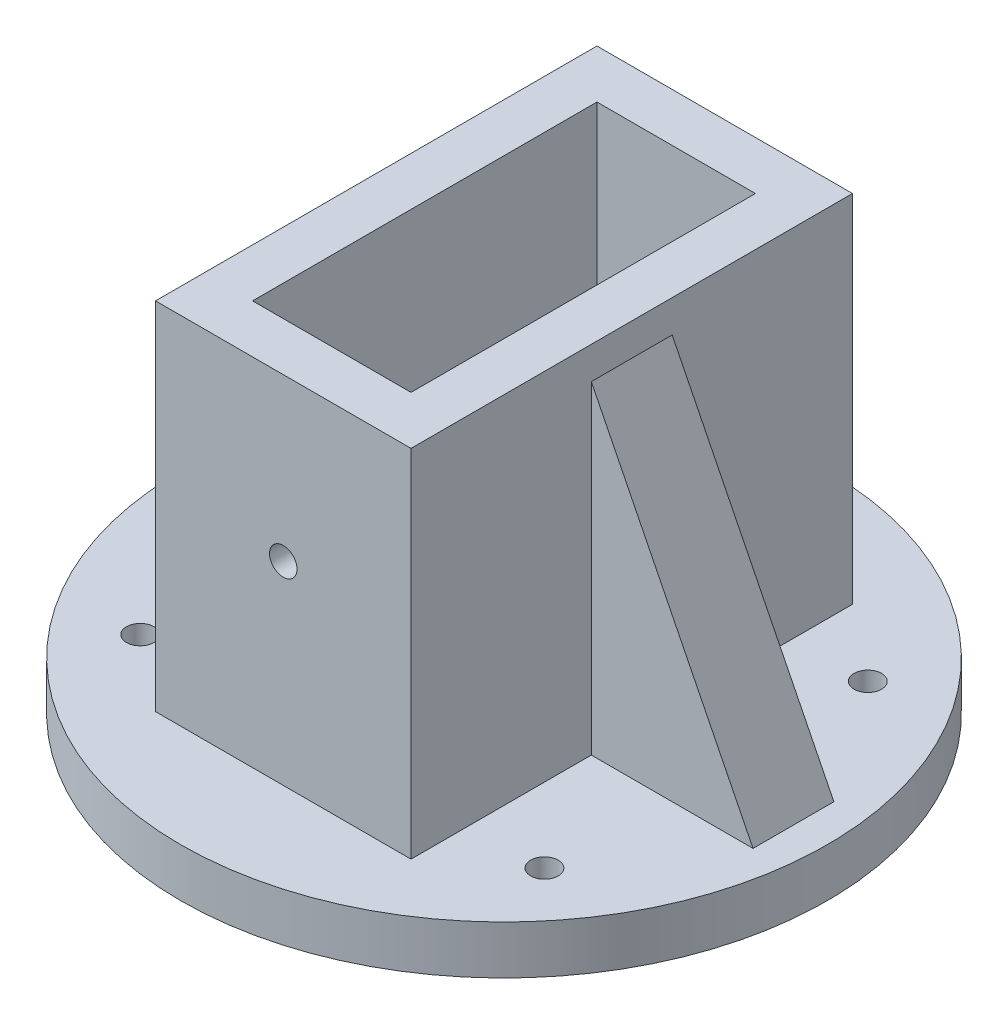
ISO-10303-21;
HEADER;
FILE_DESCRIPTION(('STEP AP214'),'2;1');
FILE_NAME('part.step','',(''),(''),'','','');
FILE_SCHEMA(('AUTOMOTIVE_DESIGN { 1 0 10303 214 1 1 1 1 }'));
ENDSEC;
DATA;
#1=APPLICATION_CONTEXT('core data for automotive mechanical design processes');
#2=APPLICATION_PROTOCOL_DEFINITION('international standard','automotive_design',2000,#1);
#3=PRODUCT_CONTEXT('',#1,'mechanical');
#4=PRODUCT('Part','Part','',(#3));
#5=PRODUCT_RELATED_PRODUCT_CATEGORY('part','',(#4));
#6=PRODUCT_DEFINITION_FORMATION('','',#4);
#7=PRODUCT_DEFINITION_CONTEXT('part definition',#1,'design');
#8=PRODUCT_DEFINITION('design','',#6,#7);
#9=PRODUCT_DEFINITION_SHAPE('','',#8);
#10=(LENGTH_UNIT() NAMED_UNIT(*) SI_UNIT(.MILLI.,.METRE.));
#11=(NAMED_UNIT(*) PLANE_ANGLE_UNIT() SI_UNIT($,.RADIAN.));
#12=(NAMED_UNIT(*) SI_UNIT($,.STERADIAN.) SOLID_ANGLE_UNIT());
#13=UNCERTAINTY_MEASURE_WITH_UNIT(LENGTH_MEASURE(1.E-05),#10,'distance_accuracy_value','');
#14=(GEOMETRIC_REPRESENTATION_CONTEXT(3) GLOBAL_UNCERTAINTY_ASSIGNED_CONTEXT((#13)) GLOBAL_UNIT_ASSIGNED_CONTEXT((#10,
#11,#12)) REPRESENTATION_CONTEXT('',''));
#15=CARTESIAN_POINT('',(0.,0.,0.));
#16=DIRECTION('',(0.,0.,1.));
#17=DIRECTION('',(1.,0.,0.));
#18=AXIS2_PLACEMENT_3D('',#15,#16,#17);
#19=CARTESIAN_POINT('',(-15.8,50.,27.3));
#20=DIRECTION('',(1.,0.,0.));
#21=DIRECTION('',(0.,0.,-1.));
#22=AXIS2_PLACEMENT_3D('',#19,#20,#21);
#23=PLANE('',#22);
#24=DIRECTION('',(0.,-1.,0.));
#25=VECTOR('',#24,1.);
#26=CARTESIAN_POINT('',(-15.8,50.,27.3));
#27=LINE('',#26,#25);
#28=CARTESIAN_POINT('',(-15.8,50.,27.3));
#29=VERTEX_POINT('',#28);
#30=CARTESIAN_POINT('',(-15.8,6.,27.3));
#31=VERTEX_POINT('',#30);
#32=EDGE_CURVE('E48',#29,#31,#27,.T.);
#33=ORIENTED_EDGE('',*,*,#32,.F.);
#34=DIRECTION('',(0.,0.,1.));
#35=VECTOR('',#34,1.);
#36=CARTESIAN_POINT('',(-15.8,50.,27.3));
#37=LINE('',#36,#35);
#38=CARTESIAN_POINT('',(-15.8,50.,-27.3));
#39=VERTEX_POINT('',#38);
#40=EDGE_CURVE('E265',#39,#29,#37,.T.);
#41=ORIENTED_EDGE('',*,*,#40,.F.);
#42=DIRECTION('',(0.,-1.,0.));
#43=VECTOR('',#42,1.);
#44=CARTESIAN_POINT('',(-15.8,50.,-27.3));
#45=LINE('',#44,#43);
#46=CARTESIAN_POINT('',(-15.8,6.,-27.3));
#47=VERTEX_POINT('',#46);
#48=EDGE_CURVE('E277',#39,#47,#45,.T.);
#49=ORIENTED_EDGE('',*,*,#48,.T.);
#50=DIRECTION('',(0.,0.,-1.));
#51=VECTOR('',#50,1.);
#52=CARTESIAN_POINT('',(-15.8,6.,27.3));
#53=LINE('',#52,#51);
#54=CARTESIAN_POINT('',(-15.8,6.,-5.));
#55=VERTEX_POINT('',#54);
#56=EDGE_CURVE('E232',#55,#47,#53,.T.);
#57=ORIENTED_EDGE('',*,*,#56,.F.);
#58=DIRECTION('',(0.,-1.,0.));
#59=VECTOR('',#58,1.);
#60=CARTESIAN_POINT('',(-15.8,50.,-5.));
#61=LINE('',#60,#59);
#62=CARTESIAN_POINT('',(-15.8,46.,-5.));
#63=VERTEX_POINT('',#62);
#64=EDGE_CURVE('E193',#63,#55,#61,.T.);
#65=ORIENTED_EDGE('',*,*,#64,.F.);
#66=DIRECTION('',(0.,0.,1.));
#67=VECTOR('',#66,1.);
#68=CARTESIAN_POINT('',(-15.8,46.,27.3));
#69=LINE('',#68,#67);
#70=CARTESIAN_POINT('',(-15.8,46.,5.));
#71=VERTEX_POINT('',#70);
#72=EDGE_CURVE('E206',#63,#71,#69,.T.);
#73=ORIENTED_EDGE('',*,*,#72,.T.);
#74=DIRECTION('',(0.,-1.,0.));
#75=VECTOR('',#74,1.);
#76=CARTESIAN_POINT('',(-15.8,50.,5.));
#77=LINE('',#76,#75);
#78=CARTESIAN_POINT('',(-15.8,6.,5.));
#79=VERTEX_POINT('',#78);
#80=EDGE_CURVE('E200',#71,#79,#77,.T.);
#81=ORIENTED_EDGE('',*,*,#80,.T.);
#82=EDGE_CURVE('E233',#31,#79,#53,.T.);
#83=ORIENTED_EDGE('',*,*,#82,.F.);
#84=EDGE_LOOP('',(#33,#41,#49,#57,#65,#73,#81,#83));
#85=FACE_BOUND('',#84,.T.);
#86=ADVANCED_FACE('F39',(#85),#23,.F.);
#87=CARTESIAN_POINT('',(15.8,50.,27.3));
#88=DIRECTION('',(0.,0.,-1.));
#89=DIRECTION('',(-1.,0.,0.));
#90=AXIS2_PLACEMENT_3D('',#87,#88,#89);
#91=PLANE('',#90);
#92=CARTESIAN_POINT('',(0.,30.,27.3));
#93=DIRECTION('',(0.,0.,1.));
#94=DIRECTION('',(1.,0.,0.));
#95=AXIS2_PLACEMENT_3D('',#92,#93,#94);
#96=CIRCLE('',#95,1.7);
#97=CARTESIAN_POINT('',(1.7,30.,27.3));
#98=VERTEX_POINT('',#97);
#99=EDGE_CURVE('E618',#98,#98,#96,.T.);
#100=ORIENTED_EDGE('',*,*,#99,.F.);
#101=EDGE_LOOP('',(#100));
#102=FACE_BOUND('',#101,.T.);
#103=DIRECTION('',(-1.,0.,0.));
#104=VECTOR('',#103,1.);
#105=CARTESIAN_POINT('',(15.8,6.,27.3));
#106=LINE('',#105,#104);
#107=CARTESIAN_POINT('',(15.8,6.,27.3));
#108=VERTEX_POINT('',#107);
#109=EDGE_CURVE('E151',#108,#31,#106,.T.);
#110=ORIENTED_EDGE('',*,*,#109,.F.);
#111=DIRECTION('',(0.,-1.,0.));
#112=VECTOR('',#111,1.);
#113=CARTESIAN_POINT('',(15.8,50.,27.3));
#114=LINE('',#113,#112);
#115=CARTESIAN_POINT('',(15.8,50.,27.3));
#116=VERTEX_POINT('',#115);
#117=EDGE_CURVE('E284',#116,#108,#114,.T.);
#118=ORIENTED_EDGE('',*,*,#117,.F.);
#119=DIRECTION('',(1.,0.,0.));
#120=VECTOR('',#119,1.);
#121=CARTESIAN_POINT('',(15.8,50.,27.3));
#122=LINE('',#121,#120);
#123=EDGE_CURVE('E268',#29,#116,#122,.T.);
#124=ORIENTED_EDGE('',*,*,#123,.F.);
#125=ORIENTED_EDGE('',*,*,#32,.T.);
#126=EDGE_LOOP('',(#110,#118,#124,#125));
#127=FACE_BOUND('',#126,.T.);
#128=ADVANCED_FACE('F331',(#102,#127),#91,.F.);
#129=CARTESIAN_POINT('',(15.8,50.,27.3));
#130=DIRECTION('',(-1.,0.,0.));
#131=DIRECTION('',(0.,0.,1.));
#132=AXIS2_PLACEMENT_3D('',#129,#130,#131);
#133=PLANE('',#132);
#134=DIRECTION('',(0.,0.,1.));
#135=VECTOR('',#134,1.);
#136=CARTESIAN_POINT('',(15.8,6.,27.3));
#137=LINE('',#136,#135);
#138=CARTESIAN_POINT('',(15.8,6.,5.));
#139=VERTEX_POINT('',#138);
#140=EDGE_CURVE('E152',#139,#108,#137,.T.);
#141=ORIENTED_EDGE('',*,*,#140,.F.);
#142=DIRECTION('',(0.,1.,0.));
#143=VECTOR('',#142,1.);
#144=CARTESIAN_POINT('',(15.8,50.,5.));
#145=LINE('',#144,#143);
#146=CARTESIAN_POINT('',(15.8,46.,5.));
#147=VERTEX_POINT('',#146);
#148=EDGE_CURVE('E56',#139,#147,#145,.T.);
#149=ORIENTED_EDGE('',*,*,#148,.T.);
#150=DIRECTION('',(0.,0.,1.));
#151=VECTOR('',#150,1.);
#152=CARTESIAN_POINT('',(15.8,46.,27.3));
#153=LINE('',#152,#151);
#154=CARTESIAN_POINT('',(15.8,46.,-5.));
#155=VERTEX_POINT('',#154);
#156=EDGE_CURVE('E60',#147,#155,#153,.F.);
#157=ORIENTED_EDGE('',*,*,#156,.T.);
#158=DIRECTION('',(0.,1.,0.));
#159=VECTOR('',#158,1.);
#160=CARTESIAN_POINT('',(15.8,50.,-5.));
#161=LINE('',#160,#159);
#162=CARTESIAN_POINT('',(15.8,6.,-5.));
#163=VERTEX_POINT('',#162);
#164=EDGE_CURVE('E154',#163,#155,#161,.T.);
#165=ORIENTED_EDGE('',*,*,#164,.F.);
#166=CARTESIAN_POINT('',(15.8,6.,-27.3));
#167=VERTEX_POINT('',#166);
#168=EDGE_CURVE('E142',#167,#163,#137,.T.);
#169=ORIENTED_EDGE('',*,*,#168,.F.);
#170=DIRECTION('',(0.,-1.,0.));
#171=VECTOR('',#170,1.);
#172=CARTESIAN_POINT('',(15.8,50.,-27.3));
#173=LINE('',#172,#171);
#174=CARTESIAN_POINT('',(15.8,50.,-27.3));
#175=VERTEX_POINT('',#174);
#176=EDGE_CURVE('E281',#175,#167,#173,.T.);
#177=ORIENTED_EDGE('',*,*,#176,.F.);
#178=DIRECTION('',(0.,0.,-1.));
#179=VECTOR('',#178,1.);
#180=CARTESIAN_POINT('',(15.8,50.,27.3));
#181=LINE('',#180,#179);
#182=EDGE_CURVE('E271',#116,#175,#181,.T.);
#183=ORIENTED_EDGE('',*,*,#182,.F.);
#184=ORIENTED_EDGE('',*,*,#117,.T.);
#185=EDGE_LOOP('',(#141,#149,#157,#165,#169,#177,#183,#184));
#186=FACE_BOUND('',#185,.T.);
#187=ADVANCED_FACE('F155',(#186),#133,.F.);
#188=CARTESIAN_POINT('',(15.8,50.,-27.3));
#189=DIRECTION('',(0.,0.,1.));
#190=DIRECTION('',(1.,0.,0.));
#191=AXIS2_PLACEMENT_3D('',#188,#189,#190);
#192=PLANE('',#191);
#193=CARTESIAN_POINT('',(0.,30.,-27.3));
#194=DIRECTION('',(0.,0.,1.));
#195=DIRECTION('',(1.,0.,0.));
#196=AXIS2_PLACEMENT_3D('',#193,#194,#195);
#197=CIRCLE('',#196,1.7);
#198=CARTESIAN_POINT('',(1.7,30.,-27.3));
#199=VERTEX_POINT('',#198);
#200=EDGE_CURVE('E609',#199,#199,#197,.T.);
#201=ORIENTED_EDGE('',*,*,#200,.T.);
#202=EDGE_LOOP('',(#201));
#203=FACE_BOUND('',#202,.T.);
#204=DIRECTION('',(1.,0.,0.));
#205=VECTOR('',#204,1.);
#206=CARTESIAN_POINT('',(15.8,6.,-27.3));
#207=LINE('',#206,#205);
#208=EDGE_CURVE('E148',#47,#167,#207,.T.);
#209=ORIENTED_EDGE('',*,*,#208,.F.);
#210=ORIENTED_EDGE('',*,*,#48,.F.);
#211=DIRECTION('',(-1.,0.,0.));
#212=VECTOR('',#211,1.);
#213=CARTESIAN_POINT('',(15.8,50.,-27.3));
#214=LINE('',#213,#212);
#215=EDGE_CURVE('E274',#175,#39,#214,.T.);
#216=ORIENTED_EDGE('',*,*,#215,.F.);
#217=ORIENTED_EDGE('',*,*,#176,.T.);
#218=EDGE_LOOP('',(#209,#210,#216,#217));
#219=FACE_BOUND('',#218,.T.);
#220=ADVANCED_FACE('F350',(#203,#219),#192,.F.);
#221=CARTESIAN_POINT('',(9.8,50.,21.3));
#222=DIRECTION('',(-1.,0.,0.));
#223=DIRECTION('',(0.,0.,1.));
#224=AXIS2_PLACEMENT_3D('',#221,#222,#223);
#225=PLANE('',#224);
#226=DIRECTION('',(0.,0.,-1.));
#227=VECTOR('',#226,1.);
#228=CARTESIAN_POINT('',(9.8,50.,21.3));
#229=LINE('',#228,#227);
#230=CARTESIAN_POINT('',(9.8,50.,21.3));
#231=VERTEX_POINT('',#230);
#232=CARTESIAN_POINT('',(9.8,50.,-21.3));
#233=VERTEX_POINT('',#232);
#234=EDGE_CURVE('E237',#231,#233,#229,.T.);
#235=ORIENTED_EDGE('',*,*,#234,.T.);
#236=DIRECTION('',(0.,-1.,0.));
#237=VECTOR('',#236,1.);
#238=CARTESIAN_POINT('',(9.8,50.,-21.3));
#239=LINE('',#238,#237);
#240=CARTESIAN_POINT('',(9.8,6.,-21.3));
#241=VERTEX_POINT('',#240);
#242=EDGE_CURVE('E261',#233,#241,#239,.T.);
#243=ORIENTED_EDGE('',*,*,#242,.T.);
#244=DIRECTION('',(0.,0.,1.));
#245=VECTOR('',#244,1.);
#246=CARTESIAN_POINT('',(9.8,6.,21.3));
#247=LINE('',#246,#245);
#248=CARTESIAN_POINT('',(9.8,6.,21.3));
#249=VERTEX_POINT('',#248);
#250=EDGE_CURVE('E224',#241,#249,#247,.T.);
#251=ORIENTED_EDGE('',*,*,#250,.T.);
#252=DIRECTION('',(0.,-1.,0.));
#253=VECTOR('',#252,1.);
#254=CARTESIAN_POINT('',(9.8,50.,21.3));
#255=LINE('',#254,#253);
#256=EDGE_CURVE('E249',#231,#249,#255,.T.);
#257=ORIENTED_EDGE('',*,*,#256,.F.);
#258=EDGE_LOOP('',(#235,#243,#251,#257));
#259=FACE_BOUND('',#258,.T.);
#260=ADVANCED_FACE('F372',(#259),#225,.T.);
#261=CARTESIAN_POINT('',(-9.8,50.,-21.3));
#262=DIRECTION('',(0.,0.,1.));
#263=DIRECTION('',(1.,0.,0.));
#264=AXIS2_PLACEMENT_3D('',#261,#262,#263);
#265=PLANE('',#264);
#266=CARTESIAN_POINT('',(0.,30.,-21.3));
#267=DIRECTION('',(0.,0.,1.));
#268=DIRECTION('',(1.,0.,0.));
#269=AXIS2_PLACEMENT_3D('',#266,#267,#268);
#270=CIRCLE('',#269,1.7);
#271=CARTESIAN_POINT('',(1.7,30.,-21.3));
#272=VERTEX_POINT('',#271);
#273=EDGE_CURVE('E615',#272,#272,#270,.T.);
#274=ORIENTED_EDGE('',*,*,#273,.F.);
#275=EDGE_LOOP('',(#274));
#276=FACE_BOUND('',#275,.T.);
#277=DIRECTION('',(0.,-1.,0.));
#278=VECTOR('',#277,1.);
#279=CARTESIAN_POINT('',(-9.8,50.,-21.3));
#280=LINE('',#279,#278);
#281=CARTESIAN_POINT('',(-9.8,50.,-21.3));
#282=VERTEX_POINT('',#281);
#283=CARTESIAN_POINT('',(-9.8,6.,-21.3));
#284=VERTEX_POINT('',#283);
#285=EDGE_CURVE('E257',#282,#284,#280,.T.);
#286=ORIENTED_EDGE('',*,*,#285,.T.);
#287=DIRECTION('',(1.,0.,0.));
#288=VECTOR('',#287,1.);
#289=CARTESIAN_POINT('',(-9.8,6.,-21.3));
#290=LINE('',#289,#288);
#291=EDGE_CURVE('E220',#284,#241,#290,.T.);
#292=ORIENTED_EDGE('',*,*,#291,.T.);
#293=ORIENTED_EDGE('',*,*,#242,.F.);
#294=DIRECTION('',(-1.,0.,0.));
#295=VECTOR('',#294,1.);
#296=CARTESIAN_POINT('',(-9.8,50.,-21.3));
#297=LINE('',#296,#295);
#298=EDGE_CURVE('E240',#233,#282,#297,.T.);
#299=ORIENTED_EDGE('',*,*,#298,.T.);
#300=EDGE_LOOP('',(#286,#292,#293,#299));
#301=FACE_BOUND('',#300,.T.);
#302=ADVANCED_FACE('F397',(#276,#301),#265,.T.);
#303=CARTESIAN_POINT('',(-9.8,50.,21.3));
#304=DIRECTION('',(1.,0.,0.));
#305=DIRECTION('',(0.,0.,-1.));
#306=AXIS2_PLACEMENT_3D('',#303,#304,#305);
#307=PLANE('',#306);
#308=DIRECTION('',(0.,0.,-1.));
#309=VECTOR('',#308,1.);
#310=CARTESIAN_POINT('',(-9.8,6.,21.3));
#311=LINE('',#310,#309);
#312=CARTESIAN_POINT('',(-9.8,6.,21.3));
#313=VERTEX_POINT('',#312);
#314=EDGE_CURVE('E214',#313,#284,#311,.T.);
#315=ORIENTED_EDGE('',*,*,#314,.T.);
#316=ORIENTED_EDGE('',*,*,#285,.F.);
#317=DIRECTION('',(0.,0.,1.));
#318=VECTOR('',#317,1.);
#319=CARTESIAN_POINT('',(-9.8,50.,21.3));
#320=LINE('',#319,#318);
#321=CARTESIAN_POINT('',(-9.8,50.,21.3));
#322=VERTEX_POINT('',#321);
#323=EDGE_CURVE('E243',#282,#322,#320,.T.);
#324=ORIENTED_EDGE('',*,*,#323,.T.);
#325=DIRECTION('',(0.,-1.,0.));
#326=VECTOR('',#325,1.);
#327=CARTESIAN_POINT('',(-9.8,50.,21.3));
#328=LINE('',#327,#326);
#329=EDGE_CURVE('E253',#322,#313,#328,.T.);
#330=ORIENTED_EDGE('',*,*,#329,.T.);
#331=EDGE_LOOP('',(#315,#316,#324,#330));
#332=FACE_BOUND('',#331,.T.);
#333=ADVANCED_FACE('F366',(#332),#307,.T.);
#334=CARTESIAN_POINT('',(-9.8,50.,21.3));
#335=DIRECTION('',(0.,0.,-1.));
#336=DIRECTION('',(-1.,0.,0.));
#337=AXIS2_PLACEMENT_3D('',#334,#335,#336);
#338=PLANE('',#337);
#339=CARTESIAN_POINT('',(0.,30.,21.3));
#340=DIRECTION('',(0.,0.,-1.));
#341=DIRECTION('',(-1.,0.,0.));
#342=AXIS2_PLACEMENT_3D('',#339,#340,#341);
#343=CIRCLE('',#342,1.7);
#344=CARTESIAN_POINT('',(-1.7,30.,21.3));
#345=VERTEX_POINT('',#344);
#346=EDGE_CURVE('E42',#345,#345,#343,.T.);
#347=ORIENTED_EDGE('',*,*,#346,.F.);
#348=EDGE_LOOP('',(#347));
#349=FACE_BOUND('',#348,.T.);
#350=ORIENTED_EDGE('',*,*,#256,.T.);
#351=DIRECTION('',(-1.,0.,0.));
#352=VECTOR('',#351,1.);
#353=CARTESIAN_POINT('',(-9.8,6.,21.3));
#354=LINE('',#353,#352);
#355=EDGE_CURVE('E11',#249,#313,#354,.T.);
#356=ORIENTED_EDGE('',*,*,#355,.T.);
#357=ORIENTED_EDGE('',*,*,#329,.F.);
#358=DIRECTION('',(1.,0.,0.));
#359=VECTOR('',#358,1.);
#360=CARTESIAN_POINT('',(-9.8,50.,21.3));
#361=LINE('',#360,#359);
#362=EDGE_CURVE('E246',#322,#231,#361,.T.);
#363=ORIENTED_EDGE('',*,*,#362,.T.);
#364=EDGE_LOOP('',(#350,#356,#357,#363));
#365=FACE_BOUND('',#364,.T.);
#366=ADVANCED_FACE('F357',(#349,#365),#338,.T.);
#367=CARTESIAN_POINT('',(0.,50.,0.));
#368=DIRECTION('',(0.,1.,0.));
#369=DIRECTION('',(0.,0.,1.));
#370=AXIS2_PLACEMENT_3D('',#367,#368,#369);
#371=PLANE('',#370);
#372=ORIENTED_EDGE('',*,*,#362,.F.);
#373=ORIENTED_EDGE('',*,*,#323,.F.);
#374=ORIENTED_EDGE('',*,*,#298,.F.);
#375=ORIENTED_EDGE('',*,*,#234,.F.);
#376=EDGE_LOOP('',(#372,#373,#374,#375));
#377=FACE_BOUND('',#376,.T.);
#378=ORIENTED_EDGE('',*,*,#40,.T.);
#379=ORIENTED_EDGE('',*,*,#123,.T.);
#380=ORIENTED_EDGE('',*,*,#182,.T.);
#381=ORIENTED_EDGE('',*,*,#215,.T.);
#382=EDGE_LOOP('',(#378,#379,#380,#381));
#383=FACE_BOUND('',#382,.T.);
#384=ADVANCED_FACE('F354',(#377,#383),#371,.T.);
#385=CARTESIAN_POINT('',(0.,6.,0.));
#386=DIRECTION('',(0.,-1.,0.));
#387=DIRECTION('',(0.,0.,-1.));
#388=AXIS2_PLACEMENT_3D('',#385,#386,#387);
#389=PLANE('',#388);
#390=ORIENTED_EDGE('',*,*,#355,.F.);
#391=ORIENTED_EDGE('',*,*,#250,.F.);
#392=ORIENTED_EDGE('',*,*,#291,.F.);
#393=ORIENTED_EDGE('',*,*,#314,.F.);
#394=EDGE_LOOP('',(#390,#391,#392,#393));
#395=FACE_BOUND('',#394,.T.);
#396=ADVANCED_FACE('F356',(#395),#389,.F.);
#397=CARTESIAN_POINT('',(25.,6.,-20.));
#398=DIRECTION('',(0.,1.,0.));
#399=DIRECTION('',(0.,0.,1.));
#400=AXIS2_PLACEMENT_3D('',#397,#398,#399);
#401=CIRCLE('',#400,1.7);
#402=CARTESIAN_POINT('',(25.,6.,-18.3));
#403=VERTEX_POINT('',#402);
#404=EDGE_CURVE('E594',#403,#403,#401,.T.);
#405=ORIENTED_EDGE('',*,*,#404,.F.);
#406=EDGE_LOOP('',(#405));
#407=FACE_BOUND('',#406,.T.);
#408=CARTESIAN_POINT('',(25.,6.,20.));
#409=DIRECTION('',(0.,1.,0.));
#410=DIRECTION('',(0.,0.,1.));
#411=AXIS2_PLACEMENT_3D('',#408,#409,#410);
#412=CIRCLE('',#411,1.7);
#413=CARTESIAN_POINT('',(25.,6.,21.7));
#414=VERTEX_POINT('',#413);
#415=EDGE_CURVE('E598',#414,#414,#412,.T.);
#416=ORIENTED_EDGE('',*,*,#415,.F.);
#417=EDGE_LOOP('',(#416));
#418=FACE_BOUND('',#417,.T.);
#419=CARTESIAN_POINT('',(-25.,6.,20.));
#420=DIRECTION('',(0.,1.,0.));
#421=DIRECTION('',(0.,0.,1.));
#422=AXIS2_PLACEMENT_3D('',#419,#420,#421);
#423=CIRCLE('',#422,1.7);
#424=CARTESIAN_POINT('',(-25.,6.,21.7));
#425=VERTEX_POINT('',#424);
#426=EDGE_CURVE('E447',#425,#425,#423,.T.);
#427=ORIENTED_EDGE('',*,*,#426,.F.);
#428=EDGE_LOOP('',(#427));
#429=FACE_BOUND('',#428,.T.);
#430=CARTESIAN_POINT('',(-25.,6.,-20.));
#431=DIRECTION('',(0.,1.,0.));
#432=DIRECTION('',(0.,0.,1.));
#433=AXIS2_PLACEMENT_3D('',#430,#431,#432);
#434=CIRCLE('',#433,1.7);
#435=CARTESIAN_POINT('',(-25.,6.,-18.3));
#436=VERTEX_POINT('',#435);
#437=EDGE_CURVE('E296',#436,#436,#434,.T.);
#438=ORIENTED_EDGE('',*,*,#437,.F.);
#439=EDGE_LOOP('',(#438));
#440=FACE_BOUND('',#439,.T.);
#441=CARTESIAN_POINT('',(0.,6.,0.));
#442=DIRECTION('',(0.,-1.,0.));
#443=DIRECTION('',(0.,0.,-1.));
#444=AXIS2_PLACEMENT_3D('',#441,#442,#443);
#445=CIRCLE('',#444,40.);
#446=CARTESIAN_POINT('',(0.,6.,-40.));
#447=VERTEX_POINT('',#446);
#448=EDGE_CURVE('E210',#447,#447,#445,.T.);
#449=ORIENTED_EDGE('',*,*,#448,.F.);
#450=EDGE_LOOP('',(#449));
#451=FACE_BOUND('',#450,.T.);
#452=DIRECTION('',(-1.,0.,0.));
#453=VECTOR('',#452,1.);
#454=CARTESIAN_POINT('',(0.,6.,5.));
#455=LINE('',#454,#453);
#456=CARTESIAN_POINT('',(-35.8,6.,5.));
#457=VERTEX_POINT('',#456);
#458=EDGE_CURVE('E197',#79,#457,#455,.T.);
#459=ORIENTED_EDGE('',*,*,#458,.T.);
#460=DIRECTION('',(0.,0.,-1.));
#461=VECTOR('',#460,1.);
#462=CARTESIAN_POINT('',(-35.8,6.,0.));
#463=LINE('',#462,#461);
#464=CARTESIAN_POINT('',(-35.8,6.,-5.));
#465=VERTEX_POINT('',#464);
#466=EDGE_CURVE('E203',#457,#465,#463,.T.);
#467=ORIENTED_EDGE('',*,*,#466,.T.);
#468=DIRECTION('',(-1.,0.,0.));
#469=VECTOR('',#468,1.);
#470=CARTESIAN_POINT('',(0.,6.,-5.));
#471=LINE('',#470,#469);
#472=EDGE_CURVE('E186',#55,#465,#471,.T.);
#473=ORIENTED_EDGE('',*,*,#472,.F.);
#474=ORIENTED_EDGE('',*,*,#56,.T.);
#475=ORIENTED_EDGE('',*,*,#208,.T.);
#476=ORIENTED_EDGE('',*,*,#168,.T.);
#477=DIRECTION('',(-1.,0.,0.));
#478=VECTOR('',#477,1.);
#479=CARTESIAN_POINT('',(0.,6.,-5.));
#480=LINE('',#479,#478);
#481=CARTESIAN_POINT('',(35.8,6.,-5.));
#482=VERTEX_POINT('',#481);
#483=EDGE_CURVE('E145',#482,#163,#480,.T.);
#484=ORIENTED_EDGE('',*,*,#483,.F.);
#485=DIRECTION('',(0.,0.,-1.));
#486=VECTOR('',#485,1.);
#487=CARTESIAN_POINT('',(35.8,6.,0.));
#488=LINE('',#487,#486);
#489=CARTESIAN_POINT('',(35.8,6.,5.));
#490=VERTEX_POINT('',#489);
#491=EDGE_CURVE('E176',#482,#490,#488,.F.);
#492=ORIENTED_EDGE('',*,*,#491,.T.);
#493=DIRECTION('',(-1.,0.,0.));
#494=VECTOR('',#493,1.);
#495=CARTESIAN_POINT('',(0.,6.,5.));
#496=LINE('',#495,#494);
#497=EDGE_CURVE('E160',#490,#139,#496,.T.);
#498=ORIENTED_EDGE('',*,*,#497,.T.);
#499=ORIENTED_EDGE('',*,*,#140,.T.);
#500=ORIENTED_EDGE('',*,*,#109,.T.);
#501=ORIENTED_EDGE('',*,*,#82,.T.);
#502=EDGE_LOOP('',(#459,#467,#473,#474,#475,#476,#484,#492,#498,#499,#500,#501));
#503=FACE_BOUND('',#502,.T.);
#504=ADVANCED_FACE('F143',(#407,#418,#429,#440,#451,#503),#389,.F.);
#505=CARTESIAN_POINT('',(0.,6.,0.));
#506=DIRECTION('',(0.,-1.,0.));
#507=DIRECTION('',(0.,0.,-1.));
#508=AXIS2_PLACEMENT_3D('',#505,#506,#507);
#509=CYLINDRICAL_SURFACE('',#508,40.);
#510=ORIENTED_EDGE('',*,*,#448,.T.);
#511=EDGE_LOOP('',(#510));
#512=FACE_BOUND('',#511,.T.);
#513=CARTESIAN_POINT('',(0.,0.,0.));
#514=DIRECTION('',(0.,-1.,0.));
#515=DIRECTION('',(0.,0.,-1.));
#516=AXIS2_PLACEMENT_3D('',#513,#514,#515);
#517=CIRCLE('',#516,40.);
#518=CARTESIAN_POINT('',(0.,0.,-40.));
#519=VERTEX_POINT('',#518);
#520=EDGE_CURVE('E209',#519,#519,#517,.T.);
#521=ORIENTED_EDGE('',*,*,#520,.F.);
#522=EDGE_LOOP('',(#521));
#523=FACE_BOUND('',#522,.T.);
#524=ADVANCED_FACE('F377',(#512,#523),#509,.T.);
#525=CARTESIAN_POINT('',(0.,0.,0.));
#526=DIRECTION('',(0.,1.,0.));
#527=DIRECTION('',(0.,0.,1.));
#528=AXIS2_PLACEMENT_3D('',#525,#526,#527);
#529=PLANE('',#528);
#530=CARTESIAN_POINT('',(25.,0.,-20.));
#531=DIRECTION('',(0.,1.,0.));
#532=DIRECTION('',(0.,0.,1.));
#533=AXIS2_PLACEMENT_3D('',#530,#531,#532);
#534=CIRCLE('',#533,1.7);
#535=CARTESIAN_POINT('',(25.,0.,-18.3));
#536=VERTEX_POINT('',#535);
#537=EDGE_CURVE('E303',#536,#536,#534,.T.);
#538=ORIENTED_EDGE('',*,*,#537,.T.);
#539=EDGE_LOOP('',(#538));
#540=FACE_BOUND('',#539,.T.);
#541=CARTESIAN_POINT('',(25.,0.,20.));
#542=DIRECTION('',(0.,1.,0.));
#543=DIRECTION('',(0.,0.,1.));
#544=AXIS2_PLACEMENT_3D('',#541,#542,#543);
#545=CIRCLE('',#544,1.7);
#546=CARTESIAN_POINT('',(25.,0.,21.7));
#547=VERTEX_POINT('',#546);
#548=EDGE_CURVE('E300',#547,#547,#545,.T.);
#549=ORIENTED_EDGE('',*,*,#548,.T.);
#550=EDGE_LOOP('',(#549));
#551=FACE_BOUND('',#550,.T.);
#552=CARTESIAN_POINT('',(-25.,0.,20.));
#553=DIRECTION('',(0.,1.,0.));
#554=DIRECTION('',(0.,0.,1.));
#555=AXIS2_PLACEMENT_3D('',#552,#553,#554);
#556=CIRCLE('',#555,1.7);
#557=CARTESIAN_POINT('',(-25.,0.,21.7));
#558=VERTEX_POINT('',#557);
#559=EDGE_CURVE('E295',#558,#558,#556,.T.);
#560=ORIENTED_EDGE('',*,*,#559,.T.);
#561=EDGE_LOOP('',(#560));
#562=FACE_BOUND('',#561,.T.);
#563=CARTESIAN_POINT('',(-25.,0.,-20.));
#564=DIRECTION('',(0.,1.,0.));
#565=DIRECTION('',(0.,0.,1.));
#566=AXIS2_PLACEMENT_3D('',#563,#564,#565);
#567=CIRCLE('',#566,1.7);
#568=CARTESIAN_POINT('',(-25.,0.,-18.3));
#569=VERTEX_POINT('',#568);
#570=EDGE_CURVE('E291',#569,#569,#567,.T.);
#571=ORIENTED_EDGE('',*,*,#570,.T.);
#572=EDGE_LOOP('',(#571));
#573=FACE_BOUND('',#572,.T.);
#574=ORIENTED_EDGE('',*,*,#520,.T.);
#575=EDGE_LOOP('',(#574));
#576=FACE_BOUND('',#575,.T.);
#577=ADVANCED_FACE('F309',(#540,#551,#562,#573,#576),#529,.F.);
#578=CARTESIAN_POINT('',(-15.8,46.,0.));
#579=DIRECTION('',(-0.894427190999916,0.447213595499958,0.));
#580=DIRECTION('',(-0.447213595499958,-0.894427190999916,0.));
#581=AXIS2_PLACEMENT_3D('',#578,#579,#580);
#582=PLANE('',#581);
#583=ORIENTED_EDGE('',*,*,#72,.F.);
#584=DIRECTION('',(-0.447213595499958,-0.894427190999916,0.));
#585=VECTOR('',#584,1.);
#586=CARTESIAN_POINT('',(-15.8,46.,-5.));
#587=LINE('',#586,#585);
#588=EDGE_CURVE('E181',#63,#465,#587,.T.);
#589=ORIENTED_EDGE('',*,*,#588,.T.);
#590=ORIENTED_EDGE('',*,*,#466,.F.);
#591=DIRECTION('',(-0.447213595499958,-0.894427190999916,0.));
#592=VECTOR('',#591,1.);
#593=CARTESIAN_POINT('',(-15.8,46.,5.));
#594=LINE('',#593,#592);
#595=EDGE_CURVE('E182',#71,#457,#594,.T.);
#596=ORIENTED_EDGE('',*,*,#595,.F.);
#597=EDGE_LOOP('',(#583,#589,#590,#596));
#598=FACE_BOUND('',#597,.T.);
#599=ADVANCED_FACE('F376',(#598),#582,.T.);
#600=CARTESIAN_POINT('',(0.,25.,5.));
#601=DIRECTION('',(0.,0.,1.));
#602=DIRECTION('',(1.,0.,0.));
#603=AXIS2_PLACEMENT_3D('',#600,#601,#602);
#604=PLANE('',#603);
#605=ORIENTED_EDGE('',*,*,#80,.F.);
#606=ORIENTED_EDGE('',*,*,#595,.T.);
#607=ORIENTED_EDGE('',*,*,#458,.F.);
#608=EDGE_LOOP('',(#605,#606,#607));
#609=FACE_BOUND('',#608,.T.);
#610=ADVANCED_FACE('F465',(#609),#604,.T.);
#611=CARTESIAN_POINT('',(0.,25.,-5.));
#612=DIRECTION('',(0.,0.,1.));
#613=DIRECTION('',(1.,0.,0.));
#614=AXIS2_PLACEMENT_3D('',#611,#612,#613);
#615=PLANE('',#614);
#616=ORIENTED_EDGE('',*,*,#588,.F.);
#617=ORIENTED_EDGE('',*,*,#64,.T.);
#618=ORIENTED_EDGE('',*,*,#472,.T.);
#619=EDGE_LOOP('',(#616,#617,#618));
#620=FACE_BOUND('',#619,.T.);
#621=ADVANCED_FACE('F467',(#620),#615,.F.);
#622=CARTESIAN_POINT('',(15.8,46.,0.));
#623=DIRECTION('',(-0.894427190999916,-0.447213595499958,0.));
#624=DIRECTION('',(0.447213595499958,-0.894427190999916,0.));
#625=AXIS2_PLACEMENT_3D('',#622,#623,#624);
#626=PLANE('',#625);
#627=ORIENTED_EDGE('',*,*,#156,.F.);
#628=DIRECTION('',(0.447213595499958,-0.894427190999916,0.));
#629=VECTOR('',#628,1.);
#630=CARTESIAN_POINT('',(15.8,46.,5.));
#631=LINE('',#630,#629);
#632=EDGE_CURVE('E165',#147,#490,#631,.T.);
#633=ORIENTED_EDGE('',*,*,#632,.T.);
#634=ORIENTED_EDGE('',*,*,#491,.F.);
#635=DIRECTION('',(0.447213595499958,-0.894427190999916,0.));
#636=VECTOR('',#635,1.);
#637=CARTESIAN_POINT('',(15.8,46.,-5.));
#638=LINE('',#637,#636);
#639=EDGE_CURVE('E163',#155,#482,#638,.T.);
#640=ORIENTED_EDGE('',*,*,#639,.F.);
#641=EDGE_LOOP('',(#627,#633,#634,#640));
#642=FACE_BOUND('',#641,.T.);
#643=ADVANCED_FACE('F470',(#642),#626,.F.);
#644=CARTESIAN_POINT('',(0.,25.,5.));
#645=DIRECTION('',(0.,0.,1.));
#646=DIRECTION('',(1.,0.,0.));
#647=AXIS2_PLACEMENT_3D('',#644,#645,#646);
#648=PLANE('',#647);
#649=ORIENTED_EDGE('',*,*,#148,.F.);
#650=ORIENTED_EDGE('',*,*,#497,.F.);
#651=ORIENTED_EDGE('',*,*,#632,.F.);
#652=EDGE_LOOP('',(#649,#650,#651));
#653=FACE_BOUND('',#652,.T.);
#654=ADVANCED_FACE('F477',(#653),#648,.T.);
#655=CARTESIAN_POINT('',(0.,25.,-5.));
#656=DIRECTION('',(0.,0.,1.));
#657=DIRECTION('',(1.,0.,0.));
#658=AXIS2_PLACEMENT_3D('',#655,#656,#657);
#659=PLANE('',#658);
#660=ORIENTED_EDGE('',*,*,#483,.T.);
#661=ORIENTED_EDGE('',*,*,#164,.T.);
#662=ORIENTED_EDGE('',*,*,#639,.T.);
#663=EDGE_LOOP('',(#660,#661,#662));
#664=FACE_BOUND('',#663,.T.);
#665=ADVANCED_FACE('F162',(#664),#659,.F.);
#666=CARTESIAN_POINT('',(-25.,-4.,-20.));
#667=DIRECTION('',(0.,1.,0.));
#668=DIRECTION('',(0.,0.,1.));
#669=AXIS2_PLACEMENT_3D('',#666,#667,#668);
#670=CYLINDRICAL_SURFACE('',#669,1.7);
#671=ORIENTED_EDGE('',*,*,#437,.T.);
#672=EDGE_LOOP('',(#671));
#673=FACE_BOUND('',#672,.T.);
#674=ORIENTED_EDGE('',*,*,#570,.F.);
#675=EDGE_LOOP('',(#674));
#676=FACE_BOUND('',#675,.T.);
#677=ADVANCED_FACE('F438',(#673,#676),#670,.F.);
#678=CARTESIAN_POINT('',(-25.,-4.,20.));
#679=DIRECTION('',(0.,1.,0.));
#680=DIRECTION('',(0.,0.,1.));
#681=AXIS2_PLACEMENT_3D('',#678,#679,#680);
#682=CYLINDRICAL_SURFACE('',#681,1.7);
#683=ORIENTED_EDGE('',*,*,#426,.T.);
#684=EDGE_LOOP('',(#683));
#685=FACE_BOUND('',#684,.T.);
#686=ORIENTED_EDGE('',*,*,#559,.F.);
#687=EDGE_LOOP('',(#686));
#688=FACE_BOUND('',#687,.T.);
#689=ADVANCED_FACE('F325',(#685,#688),#682,.F.);
#690=CARTESIAN_POINT('',(25.,-4.,20.));
#691=DIRECTION('',(0.,1.,0.));
#692=DIRECTION('',(0.,0.,1.));
#693=AXIS2_PLACEMENT_3D('',#690,#691,#692);
#694=CYLINDRICAL_SURFACE('',#693,1.7);
#695=ORIENTED_EDGE('',*,*,#415,.T.);
#696=EDGE_LOOP('',(#695));
#697=FACE_BOUND('',#696,.T.);
#698=ORIENTED_EDGE('',*,*,#548,.F.);
#699=EDGE_LOOP('',(#698));
#700=FACE_BOUND('',#699,.T.);
#701=ADVANCED_FACE('F315',(#697,#700),#694,.F.);
#702=CARTESIAN_POINT('',(25.,-4.,-20.));
#703=DIRECTION('',(0.,1.,0.));
#704=DIRECTION('',(0.,0.,1.));
#705=AXIS2_PLACEMENT_3D('',#702,#703,#704);
#706=CYLINDRICAL_SURFACE('',#705,1.7);
#707=ORIENTED_EDGE('',*,*,#404,.T.);
#708=EDGE_LOOP('',(#707));
#709=FACE_BOUND('',#708,.T.);
#710=ORIENTED_EDGE('',*,*,#537,.F.);
#711=EDGE_LOOP('',(#710));
#712=FACE_BOUND('',#711,.T.);
#713=ADVANCED_FACE('F312',(#709,#712),#706,.F.);
#714=CARTESIAN_POINT('',(0.,30.,-32.7));
#715=DIRECTION('',(0.,0.,1.));
#716=DIRECTION('',(1.,0.,0.));
#717=AXIS2_PLACEMENT_3D('',#714,#715,#716);
#718=CYLINDRICAL_SURFACE('',#717,1.7);
#719=ORIENTED_EDGE('',*,*,#346,.T.);
#720=EDGE_LOOP('',(#719));
#721=FACE_BOUND('',#720,.T.);
#722=ORIENTED_EDGE('',*,*,#99,.T.);
#723=EDGE_LOOP('',(#722));
#724=FACE_BOUND('',#723,.T.);
#725=ADVANCED_FACE('F314',(#721,#724),#718,.F.);
#726=ORIENTED_EDGE('',*,*,#273,.T.);
#727=EDGE_LOOP('',(#726));
#728=FACE_BOUND('',#727,.T.);
#729=ORIENTED_EDGE('',*,*,#200,.F.);
#730=EDGE_LOOP('',(#729));
#731=FACE_BOUND('',#730,.T.);
#732=ADVANCED_FACE('F322',(#728,#731),#718,.F.);
#733=CLOSED_SHELL('',(#86,#128,#187,#220,#260,#302,#333,#366,#384,#396,#504,#524,#577,#599,#610,
#621,#643,#654,#665,#677,#689,#701,#713,#725,#732));
#734=MANIFOLD_SOLID_BREP('B2',#733);
#735=ADVANCED_BREP_SHAPE_REPRESENTATION('',(#18,#734),#14);
#736=SHAPE_DEFINITION_REPRESENTATION(#9,#735);
ENDSEC;
END-ISO-10303-21;
